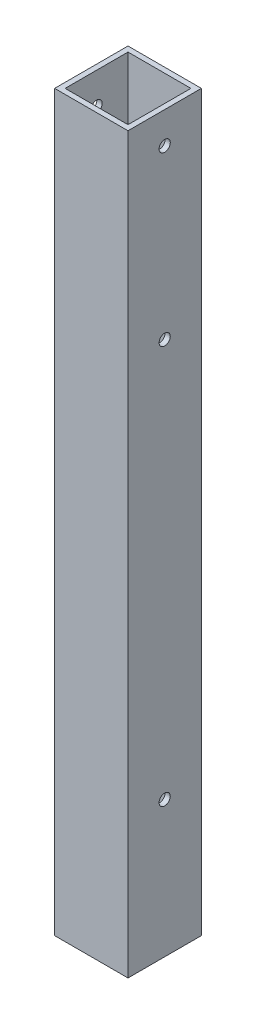
ISO-10303-21;
HEADER;
FILE_DESCRIPTION(('STEP AP214'),'2;1');
FILE_NAME('part.step','',(''),(''),'','','');
FILE_SCHEMA(('AUTOMOTIVE_DESIGN { 1 0 10303 214 1 1 1 1 }'));
ENDSEC;
DATA;
#1=APPLICATION_CONTEXT('core data for automotive mechanical design processes');
#2=APPLICATION_PROTOCOL_DEFINITION('international standard','automotive_design',2000,#1);
#3=PRODUCT_CONTEXT('',#1,'mechanical');
#4=PRODUCT('Part','Part','',(#3));
#5=PRODUCT_RELATED_PRODUCT_CATEGORY('part','',(#4));
#6=PRODUCT_DEFINITION_FORMATION('','',#4);
#7=PRODUCT_DEFINITION_CONTEXT('part definition',#1,'design');
#8=PRODUCT_DEFINITION('design','',#6,#7);
#9=PRODUCT_DEFINITION_SHAPE('','',#8);
#10=(LENGTH_UNIT() NAMED_UNIT(*) SI_UNIT(.MILLI.,.METRE.));
#11=(NAMED_UNIT(*) PLANE_ANGLE_UNIT() SI_UNIT($,.RADIAN.));
#12=(NAMED_UNIT(*) SI_UNIT($,.STERADIAN.) SOLID_ANGLE_UNIT());
#13=UNCERTAINTY_MEASURE_WITH_UNIT(LENGTH_MEASURE(1.E-05),#10,'distance_accuracy_value','');
#14=(GEOMETRIC_REPRESENTATION_CONTEXT(3) GLOBAL_UNCERTAINTY_ASSIGNED_CONTEXT((#13)) GLOBAL_UNIT_ASSIGNED_CONTEXT((#10,
#11,#12)) REPRESENTATION_CONTEXT('',''));
#15=CARTESIAN_POINT('',(0.,0.,0.));
#16=DIRECTION('',(0.,0.,1.));
#17=DIRECTION('',(1.,0.,0.));
#18=AXIS2_PLACEMENT_3D('',#15,#16,#17);
#19=CARTESIAN_POINT('',(-405.487908181794,205.374266552925,22.225));
#20=DIRECTION('',(-1.,0.,0.));
#21=DIRECTION('',(0.,0.,1.));
#22=AXIS2_PLACEMENT_3D('',#19,#20,#21);
#23=CYLINDRICAL_SURFACE('',#22,3.3782);
#24=CARTESIAN_POINT('',(0.,205.374266552925,22.225));
#25=DIRECTION('',(-1.,0.,0.));
#26=DIRECTION('',(0.,0.,1.));
#27=AXIS2_PLACEMENT_3D('',#24,#25,#26);
#28=CIRCLE('',#27,3.3782);
#29=CARTESIAN_POINT('',(0.,205.374266552925,25.6032));
#30=VERTEX_POINT('',#29);
#31=EDGE_CURVE('E116',#30,#30,#28,.T.);
#32=ORIENTED_EDGE('',*,*,#31,.T.);
#33=EDGE_LOOP('',(#32));
#34=FACE_BOUND('',#33,.T.);
#35=CARTESIAN_POINT('',(3.17499999999998,205.374266552925,22.225));
#36=DIRECTION('',(-1.,0.,0.));
#37=DIRECTION('',(0.,0.,1.));
#38=AXIS2_PLACEMENT_3D('',#35,#36,#37);
#39=CIRCLE('',#38,3.3782);
#40=CARTESIAN_POINT('',(3.17499999999998,205.374266552925,25.6032));
#41=VERTEX_POINT('',#40);
#42=EDGE_CURVE('E17',#41,#41,#39,.T.);
#43=ORIENTED_EDGE('',*,*,#42,.F.);
#44=EDGE_LOOP('',(#43));
#45=FACE_BOUND('',#44,.T.);
#46=ADVANCED_FACE('F14',(#34,#45),#23,.F.);
#47=CARTESIAN_POINT('',(-405.487908181794,446.674266552925,22.225));
#48=DIRECTION('',(-1.,0.,0.));
#49=DIRECTION('',(0.,0.,1.));
#50=AXIS2_PLACEMENT_3D('',#47,#48,#49);
#51=CYLINDRICAL_SURFACE('',#50,3.3782);
#52=CARTESIAN_POINT('',(0.,446.674266552925,22.225));
#53=DIRECTION('',(-1.,0.,0.));
#54=DIRECTION('',(0.,0.,1.));
#55=AXIS2_PLACEMENT_3D('',#52,#53,#54);
#56=CIRCLE('',#55,3.3782);
#57=CARTESIAN_POINT('',(0.,446.674266552925,25.6032));
#58=VERTEX_POINT('',#57);
#59=EDGE_CURVE('E134',#58,#58,#56,.T.);
#60=ORIENTED_EDGE('',*,*,#59,.T.);
#61=EDGE_LOOP('',(#60));
#62=FACE_BOUND('',#61,.T.);
#63=CARTESIAN_POINT('',(3.17499999999998,446.674266552925,22.225));
#64=DIRECTION('',(-1.,0.,0.));
#65=DIRECTION('',(0.,0.,1.));
#66=AXIS2_PLACEMENT_3D('',#63,#64,#65);
#67=CIRCLE('',#66,3.3782);
#68=CARTESIAN_POINT('',(3.17499999999998,446.674266552925,25.6032));
#69=VERTEX_POINT('',#68);
#70=EDGE_CURVE('E147',#69,#69,#67,.T.);
#71=ORIENTED_EDGE('',*,*,#70,.F.);
#72=EDGE_LOOP('',(#71));
#73=FACE_BOUND('',#72,.T.);
#74=ADVANCED_FACE('F156',(#62,#73),#51,.F.);
#75=CARTESIAN_POINT('',(-405.487908181794,548.274266552925,22.225));
#76=DIRECTION('',(-1.,0.,0.));
#77=DIRECTION('',(0.,0.,1.));
#78=AXIS2_PLACEMENT_3D('',#75,#76,#77);
#79=CYLINDRICAL_SURFACE('',#78,3.3782);
#80=CARTESIAN_POINT('',(0.,548.274266552925,22.225));
#81=DIRECTION('',(-1.,0.,0.));
#82=DIRECTION('',(0.,0.,1.));
#83=AXIS2_PLACEMENT_3D('',#80,#81,#82);
#84=CIRCLE('',#83,3.3782);
#85=CARTESIAN_POINT('',(0.,548.274266552925,25.6032));
#86=VERTEX_POINT('',#85);
#87=EDGE_CURVE('E113',#86,#86,#84,.T.);
#88=ORIENTED_EDGE('',*,*,#87,.T.);
#89=EDGE_LOOP('',(#88));
#90=FACE_BOUND('',#89,.T.);
#91=CARTESIAN_POINT('',(3.17499999999998,548.274266552925,22.225));
#92=DIRECTION('',(-1.,0.,0.));
#93=DIRECTION('',(0.,0.,1.));
#94=AXIS2_PLACEMENT_3D('',#91,#92,#93);
#95=CIRCLE('',#94,3.3782);
#96=CARTESIAN_POINT('',(3.17499999999998,548.274266552925,25.6032));
#97=VERTEX_POINT('',#96);
#98=EDGE_CURVE('E121',#97,#97,#95,.T.);
#99=ORIENTED_EDGE('',*,*,#98,.F.);
#100=EDGE_LOOP('',(#99));
#101=FACE_BOUND('',#100,.T.);
#102=ADVANCED_FACE('F162',(#90,#101),#79,.F.);
#103=CARTESIAN_POINT('',(-405.487908181794,205.374266552925,22.225));
#104=DIRECTION('',(-1.,0.,0.));
#105=DIRECTION('',(0.,0.,1.));
#106=AXIS2_PLACEMENT_3D('',#103,#104,#105);
#107=CYLINDRICAL_SURFACE('',#106,3.3782);
#108=CARTESIAN_POINT('',(41.275,205.374266552925,22.225));
#109=DIRECTION('',(-1.,0.,0.));
#110=DIRECTION('',(0.,0.,1.));
#111=AXIS2_PLACEMENT_3D('',#108,#109,#110);
#112=CIRCLE('',#111,3.3782);
#113=CARTESIAN_POINT('',(41.275,205.374266552925,25.6032));
#114=VERTEX_POINT('',#113);
#115=EDGE_CURVE('E86',#114,#114,#112,.T.);
#116=ORIENTED_EDGE('',*,*,#115,.T.);
#117=EDGE_LOOP('',(#116));
#118=FACE_BOUND('',#117,.T.);
#119=CARTESIAN_POINT('',(44.45,205.374266552925,22.225));
#120=DIRECTION('',(-1.,0.,0.));
#121=DIRECTION('',(0.,0.,1.));
#122=AXIS2_PLACEMENT_3D('',#119,#120,#121);
#123=CIRCLE('',#122,3.3782);
#124=CARTESIAN_POINT('',(44.45,205.374266552925,25.6032));
#125=VERTEX_POINT('',#124);
#126=EDGE_CURVE('E129',#125,#125,#123,.T.);
#127=ORIENTED_EDGE('',*,*,#126,.F.);
#128=EDGE_LOOP('',(#127));
#129=FACE_BOUND('',#128,.T.);
#130=ADVANCED_FACE('F208',(#118,#129),#107,.F.);
#131=CARTESIAN_POINT('',(-405.487908181794,446.674266552925,22.225));
#132=DIRECTION('',(-1.,0.,0.));
#133=DIRECTION('',(0.,0.,1.));
#134=AXIS2_PLACEMENT_3D('',#131,#132,#133);
#135=CYLINDRICAL_SURFACE('',#134,3.3782);
#136=CARTESIAN_POINT('',(41.275,446.674266552925,22.225));
#137=DIRECTION('',(-1.,0.,0.));
#138=DIRECTION('',(0.,0.,1.));
#139=AXIS2_PLACEMENT_3D('',#136,#137,#138);
#140=CIRCLE('',#139,3.3782);
#141=CARTESIAN_POINT('',(41.275,446.674266552925,25.6032));
#142=VERTEX_POINT('',#141);
#143=EDGE_CURVE('E141',#142,#142,#140,.T.);
#144=ORIENTED_EDGE('',*,*,#143,.T.);
#145=EDGE_LOOP('',(#144));
#146=FACE_BOUND('',#145,.T.);
#147=CARTESIAN_POINT('',(44.45,446.674266552925,22.225));
#148=DIRECTION('',(-1.,0.,0.));
#149=DIRECTION('',(0.,0.,1.));
#150=AXIS2_PLACEMENT_3D('',#147,#148,#149);
#151=CIRCLE('',#150,3.3782);
#152=CARTESIAN_POINT('',(44.45,446.674266552925,25.6032));
#153=VERTEX_POINT('',#152);
#154=EDGE_CURVE('E126',#153,#153,#151,.T.);
#155=ORIENTED_EDGE('',*,*,#154,.F.);
#156=EDGE_LOOP('',(#155));
#157=FACE_BOUND('',#156,.T.);
#158=ADVANCED_FACE('F204',(#146,#157),#135,.F.);
#159=CARTESIAN_POINT('',(-405.487908181794,548.274266552925,22.225));
#160=DIRECTION('',(-1.,0.,0.));
#161=DIRECTION('',(0.,0.,1.));
#162=AXIS2_PLACEMENT_3D('',#159,#160,#161);
#163=CYLINDRICAL_SURFACE('',#162,3.3782);
#164=CARTESIAN_POINT('',(41.275,548.274266552925,22.225));
#165=DIRECTION('',(-1.,0.,0.));
#166=DIRECTION('',(0.,0.,1.));
#167=AXIS2_PLACEMENT_3D('',#164,#165,#166);
#168=CIRCLE('',#167,3.3782);
#169=CARTESIAN_POINT('',(41.275,548.274266552925,25.6032));
#170=VERTEX_POINT('',#169);
#171=EDGE_CURVE('E118',#170,#170,#168,.T.);
#172=ORIENTED_EDGE('',*,*,#171,.T.);
#173=EDGE_LOOP('',(#172));
#174=FACE_BOUND('',#173,.T.);
#175=CARTESIAN_POINT('',(44.45,548.274266552925,22.225));
#176=DIRECTION('',(-1.,0.,0.));
#177=DIRECTION('',(0.,0.,1.));
#178=AXIS2_PLACEMENT_3D('',#175,#176,#177);
#179=CIRCLE('',#178,3.3782);
#180=CARTESIAN_POINT('',(44.45,548.274266552925,25.6032));
#181=VERTEX_POINT('',#180);
#182=EDGE_CURVE('E122',#181,#181,#179,.T.);
#183=ORIENTED_EDGE('',*,*,#182,.F.);
#184=EDGE_LOOP('',(#183));
#185=FACE_BOUND('',#184,.T.);
#186=ADVANCED_FACE('F200',(#174,#185),#163,.F.);
#187=CARTESIAN_POINT('',(44.45,345.074266552925,44.45));
#188=DIRECTION('',(0.,0.,1.));
#189=DIRECTION('',(0.,-1.,0.));
#190=AXIS2_PLACEMENT_3D('',#187,#188,#189);
#191=PLANE('',#190);
#192=DIRECTION('',(0.,1.,0.));
#193=VECTOR('',#192,1.);
#194=CARTESIAN_POINT('',(44.45,345.074266552925,44.45));
#195=LINE('',#194,#193);
#196=CARTESIAN_POINT('',(44.45,567.324266552925,44.45));
#197=VERTEX_POINT('',#196);
#198=CARTESIAN_POINT('',(44.45,122.824266552925,44.45));
#199=VERTEX_POINT('',#198);
#200=EDGE_CURVE('E341',#197,#199,#195,.F.);
#201=ORIENTED_EDGE('',*,*,#200,.F.);
#202=DIRECTION('',(1.,0.,0.));
#203=VECTOR('',#202,1.);
#204=CARTESIAN_POINT('',(44.45,567.324266552925,44.45));
#205=LINE('',#204,#203);
#206=CARTESIAN_POINT('',(0.,567.324266552925,44.45));
#207=VERTEX_POINT('',#206);
#208=EDGE_CURVE('E103',#207,#197,#205,.T.);
#209=ORIENTED_EDGE('',*,*,#208,.F.);
#210=DIRECTION('',(0.,1.,0.));
#211=VECTOR('',#210,1.);
#212=CARTESIAN_POINT('',(0.,345.074266552925,44.45));
#213=LINE('',#212,#211);
#214=CARTESIAN_POINT('',(0.,122.824266552925,44.45));
#215=VERTEX_POINT('',#214);
#216=EDGE_CURVE('E111',#207,#215,#213,.F.);
#217=ORIENTED_EDGE('',*,*,#216,.T.);
#218=DIRECTION('',(1.,0.,0.));
#219=VECTOR('',#218,1.);
#220=CARTESIAN_POINT('',(44.45,122.824266552925,44.45));
#221=LINE('',#220,#219);
#222=EDGE_CURVE('E344',#199,#215,#221,.F.);
#223=ORIENTED_EDGE('',*,*,#222,.F.);
#224=EDGE_LOOP('',(#201,#209,#217,#223));
#225=FACE_BOUND('',#224,.T.);
#226=ADVANCED_FACE('F196',(#225),#191,.T.);
#227=CARTESIAN_POINT('',(44.45,345.074266552925,3.175));
#228=DIRECTION('',(0.,0.,-1.));
#229=DIRECTION('',(0.,1.,0.));
#230=AXIS2_PLACEMENT_3D('',#227,#228,#229);
#231=PLANE('',#230);
#232=DIRECTION('',(1.,0.,0.));
#233=VECTOR('',#232,1.);
#234=CARTESIAN_POINT('',(44.45,122.824266552925,3.175));
#235=LINE('',#234,#233);
#236=CARTESIAN_POINT('',(41.275,122.824266552925,3.17500000000001));
#237=VERTEX_POINT('',#236);
#238=CARTESIAN_POINT('',(3.175,122.824266552925,3.17500000000001));
#239=VERTEX_POINT('',#238);
#240=EDGE_CURVE('E354',#237,#239,#235,.F.);
#241=ORIENTED_EDGE('',*,*,#240,.F.);
#242=DIRECTION('',(0.,1.,0.));
#243=VECTOR('',#242,1.);
#244=CARTESIAN_POINT('',(41.275,345.074266552925,3.175));
#245=LINE('',#244,#243);
#246=CARTESIAN_POINT('',(41.275,567.324266552925,3.17499999999999));
#247=VERTEX_POINT('',#246);
#248=EDGE_CURVE('E117',#237,#247,#245,.T.);
#249=ORIENTED_EDGE('',*,*,#248,.T.);
#250=DIRECTION('',(1.,0.,0.));
#251=VECTOR('',#250,1.);
#252=CARTESIAN_POINT('',(44.45,567.324266552925,3.175));
#253=LINE('',#252,#251);
#254=CARTESIAN_POINT('',(3.175,567.324266552925,3.175));
#255=VERTEX_POINT('',#254);
#256=EDGE_CURVE('E96',#255,#247,#253,.T.);
#257=ORIENTED_EDGE('',*,*,#256,.F.);
#258=DIRECTION('',(0.,1.,0.));
#259=VECTOR('',#258,1.);
#260=CARTESIAN_POINT('',(3.175,345.074266552925,3.175));
#261=LINE('',#260,#259);
#262=EDGE_CURVE('E87',#239,#255,#261,.T.);
#263=ORIENTED_EDGE('',*,*,#262,.F.);
#264=EDGE_LOOP('',(#241,#249,#257,#263));
#265=FACE_BOUND('',#264,.T.);
#266=ADVANCED_FACE('F193',(#265),#231,.F.);
#267=CARTESIAN_POINT('',(3.175,345.074266552925,22.225));
#268=DIRECTION('',(1.,0.,0.));
#269=DIRECTION('',(0.,0.,-1.));
#270=AXIS2_PLACEMENT_3D('',#267,#268,#269);
#271=PLANE('',#270);
#272=DIRECTION('',(0.,0.,1.));
#273=VECTOR('',#272,1.);
#274=CARTESIAN_POINT('',(3.175,567.324266552925,22.225));
#275=LINE('',#274,#273);
#276=CARTESIAN_POINT('',(3.175,567.324266552925,41.275));
#277=VERTEX_POINT('',#276);
#278=EDGE_CURVE('E90',#277,#255,#275,.F.);
#279=ORIENTED_EDGE('',*,*,#278,.F.);
#280=DIRECTION('',(0.,-1.,0.));
#281=VECTOR('',#280,1.);
#282=CARTESIAN_POINT('',(3.175,345.074266552925,41.275));
#283=LINE('',#282,#281);
#284=CARTESIAN_POINT('',(3.175,122.824266552925,41.275));
#285=VERTEX_POINT('',#284);
#286=EDGE_CURVE('E75',#277,#285,#283,.T.);
#287=ORIENTED_EDGE('',*,*,#286,.T.);
#288=DIRECTION('',(0.,0.,-1.));
#289=VECTOR('',#288,1.);
#290=CARTESIAN_POINT('',(3.175,122.824266552925,22.225));
#291=LINE('',#290,#289);
#292=EDGE_CURVE('E361',#239,#285,#291,.F.);
#293=ORIENTED_EDGE('',*,*,#292,.F.);
#294=ORIENTED_EDGE('',*,*,#262,.T.);
#295=EDGE_LOOP('',(#279,#287,#293,#294));
#296=FACE_BOUND('',#295,.T.);
#297=ORIENTED_EDGE('',*,*,#98,.T.);
#298=EDGE_LOOP('',(#297));
#299=FACE_BOUND('',#298,.T.);
#300=ORIENTED_EDGE('',*,*,#70,.T.);
#301=EDGE_LOOP('',(#300));
#302=FACE_BOUND('',#301,.T.);
#303=ORIENTED_EDGE('',*,*,#42,.T.);
#304=EDGE_LOOP('',(#303));
#305=FACE_BOUND('',#304,.T.);
#306=ADVANCED_FACE('F91',(#296,#299,#302,#305),#271,.T.);
#307=CARTESIAN_POINT('',(44.45,345.074266552925,41.275));
#308=DIRECTION('',(0.,0.,1.));
#309=DIRECTION('',(0.,-1.,0.));
#310=AXIS2_PLACEMENT_3D('',#307,#308,#309);
#311=PLANE('',#310);
#312=DIRECTION('',(1.,0.,0.));
#313=VECTOR('',#312,1.);
#314=CARTESIAN_POINT('',(44.45,567.324266552925,41.275));
#315=LINE('',#314,#313);
#316=CARTESIAN_POINT('',(41.275,567.324266552925,41.275));
#317=VERTEX_POINT('',#316);
#318=EDGE_CURVE('E79',#317,#277,#315,.F.);
#319=ORIENTED_EDGE('',*,*,#318,.F.);
#320=DIRECTION('',(0.,1.,0.));
#321=VECTOR('',#320,1.);
#322=CARTESIAN_POINT('',(41.275,345.074266552925,41.275));
#323=LINE('',#322,#321);
#324=CARTESIAN_POINT('',(41.275,122.824266552925,41.275));
#325=VERTEX_POINT('',#324);
#326=EDGE_CURVE('E114',#317,#325,#323,.F.);
#327=ORIENTED_EDGE('',*,*,#326,.T.);
#328=DIRECTION('',(1.,0.,0.));
#329=VECTOR('',#328,1.);
#330=CARTESIAN_POINT('',(44.45,122.824266552925,41.275));
#331=LINE('',#330,#329);
#332=EDGE_CURVE('E82',#285,#325,#331,.T.);
#333=ORIENTED_EDGE('',*,*,#332,.F.);
#334=ORIENTED_EDGE('',*,*,#286,.F.);
#335=EDGE_LOOP('',(#319,#327,#333,#334));
#336=FACE_BOUND('',#335,.T.);
#337=ADVANCED_FACE('F77',(#336),#311,.F.);
#338=CARTESIAN_POINT('',(41.275,345.074266552925,22.225));
#339=DIRECTION('',(1.,0.,0.));
#340=DIRECTION('',(0.,0.,-1.));
#341=AXIS2_PLACEMENT_3D('',#338,#339,#340);
#342=PLANE('',#341);
#343=ORIENTED_EDGE('',*,*,#326,.F.);
#344=DIRECTION('',(0.,0.,1.));
#345=VECTOR('',#344,1.);
#346=CARTESIAN_POINT('',(41.275,567.324266552925,22.225));
#347=LINE('',#346,#345);
#348=EDGE_CURVE('E102',#247,#317,#347,.T.);
#349=ORIENTED_EDGE('',*,*,#348,.F.);
#350=ORIENTED_EDGE('',*,*,#248,.F.);
#351=DIRECTION('',(0.,0.,-1.));
#352=VECTOR('',#351,1.);
#353=CARTESIAN_POINT('',(41.275,122.824266552925,22.225));
#354=LINE('',#353,#352);
#355=EDGE_CURVE('E357',#325,#237,#354,.T.);
#356=ORIENTED_EDGE('',*,*,#355,.F.);
#357=EDGE_LOOP('',(#343,#349,#350,#356));
#358=FACE_BOUND('',#357,.T.);
#359=ORIENTED_EDGE('',*,*,#171,.F.);
#360=EDGE_LOOP('',(#359));
#361=FACE_BOUND('',#360,.T.);
#362=ORIENTED_EDGE('',*,*,#143,.F.);
#363=EDGE_LOOP('',(#362));
#364=FACE_BOUND('',#363,.T.);
#365=ORIENTED_EDGE('',*,*,#115,.F.);
#366=EDGE_LOOP('',(#365));
#367=FACE_BOUND('',#366,.T.);
#368=ADVANCED_FACE('F184',(#358,#361,#364,#367),#342,.F.);
#369=CARTESIAN_POINT('',(0.,345.074266552925,22.225));
#370=DIRECTION('',(1.,0.,0.));
#371=DIRECTION('',(0.,0.,-1.));
#372=AXIS2_PLACEMENT_3D('',#369,#370,#371);
#373=PLANE('',#372);
#374=ORIENTED_EDGE('',*,*,#216,.F.);
#375=DIRECTION('',(0.,0.,1.));
#376=VECTOR('',#375,1.);
#377=CARTESIAN_POINT('',(0.,567.324266552925,22.225));
#378=LINE('',#377,#376);
#379=CARTESIAN_POINT('',(0.,567.324266552925,0.));
#380=VERTEX_POINT('',#379);
#381=EDGE_CURVE('E105',#380,#207,#378,.T.);
#382=ORIENTED_EDGE('',*,*,#381,.F.);
#383=DIRECTION('',(0.,1.,0.));
#384=VECTOR('',#383,1.);
#385=CARTESIAN_POINT('',(0.,345.074266552925,0.));
#386=LINE('',#385,#384);
#387=CARTESIAN_POINT('',(0.,122.824266552925,0.));
#388=VERTEX_POINT('',#387);
#389=EDGE_CURVE('E358',#388,#380,#386,.T.);
#390=ORIENTED_EDGE('',*,*,#389,.F.);
#391=DIRECTION('',(0.,0.,-1.));
#392=VECTOR('',#391,1.);
#393=CARTESIAN_POINT('',(0.,122.824266552925,22.225));
#394=LINE('',#393,#392);
#395=EDGE_CURVE('E345',#215,#388,#394,.T.);
#396=ORIENTED_EDGE('',*,*,#395,.F.);
#397=EDGE_LOOP('',(#374,#382,#390,#396));
#398=FACE_BOUND('',#397,.T.);
#399=ORIENTED_EDGE('',*,*,#87,.F.);
#400=EDGE_LOOP('',(#399));
#401=FACE_BOUND('',#400,.T.);
#402=ORIENTED_EDGE('',*,*,#59,.F.);
#403=EDGE_LOOP('',(#402));
#404=FACE_BOUND('',#403,.T.);
#405=ORIENTED_EDGE('',*,*,#31,.F.);
#406=EDGE_LOOP('',(#405));
#407=FACE_BOUND('',#406,.T.);
#408=ADVANCED_FACE('F181',(#398,#401,#404,#407),#373,.F.);
#409=CARTESIAN_POINT('',(44.45,567.324266552925,22.225));
#410=DIRECTION('',(0.,1.,0.));
#411=DIRECTION('',(0.,0.,1.));
#412=AXIS2_PLACEMENT_3D('',#409,#410,#411);
#413=PLANE('',#412);
#414=ORIENTED_EDGE('',*,*,#256,.T.);
#415=ORIENTED_EDGE('',*,*,#348,.T.);
#416=ORIENTED_EDGE('',*,*,#318,.T.);
#417=ORIENTED_EDGE('',*,*,#278,.T.);
#418=EDGE_LOOP('',(#414,#415,#416,#417));
#419=FACE_BOUND('',#418,.T.);
#420=DIRECTION('',(0.,0.,-1.));
#421=VECTOR('',#420,1.);
#422=CARTESIAN_POINT('',(44.45,567.324266552925,22.225));
#423=LINE('',#422,#421);
#424=CARTESIAN_POINT('',(44.45,567.324266552925,0.));
#425=VERTEX_POINT('',#424);
#426=EDGE_CURVE('E125',#425,#197,#423,.F.);
#427=ORIENTED_EDGE('',*,*,#426,.F.);
#428=DIRECTION('',(1.,0.,0.));
#429=VECTOR('',#428,1.);
#430=CARTESIAN_POINT('',(44.45,567.324266552925,0.));
#431=LINE('',#430,#429);
#432=EDGE_CURVE('E372',#380,#425,#431,.T.);
#433=ORIENTED_EDGE('',*,*,#432,.F.);
#434=ORIENTED_EDGE('',*,*,#381,.T.);
#435=ORIENTED_EDGE('',*,*,#208,.T.);
#436=EDGE_LOOP('',(#427,#433,#434,#435));
#437=FACE_BOUND('',#436,.T.);
#438=ADVANCED_FACE('F99',(#419,#437),#413,.T.);
#439=CARTESIAN_POINT('',(44.45,345.074266552925,22.225));
#440=DIRECTION('',(1.,0.,0.));
#441=DIRECTION('',(0.,0.,-1.));
#442=AXIS2_PLACEMENT_3D('',#439,#440,#441);
#443=PLANE('',#442);
#444=ORIENTED_EDGE('',*,*,#426,.T.);
#445=ORIENTED_EDGE('',*,*,#200,.T.);
#446=DIRECTION('',(0.,0.,-1.));
#447=VECTOR('',#446,1.);
#448=CARTESIAN_POINT('',(44.45,122.824266552925,22.225));
#449=LINE('',#448,#447);
#450=CARTESIAN_POINT('',(44.45,122.824266552925,0.));
#451=VERTEX_POINT('',#450);
#452=EDGE_CURVE('E32',#451,#199,#449,.F.);
#453=ORIENTED_EDGE('',*,*,#452,.F.);
#454=DIRECTION('',(0.,1.,0.));
#455=VECTOR('',#454,1.);
#456=CARTESIAN_POINT('',(44.45,345.074266552925,0.));
#457=LINE('',#456,#455);
#458=EDGE_CURVE('E23',#425,#451,#457,.F.);
#459=ORIENTED_EDGE('',*,*,#458,.F.);
#460=EDGE_LOOP('',(#444,#445,#453,#459));
#461=FACE_BOUND('',#460,.T.);
#462=ORIENTED_EDGE('',*,*,#182,.T.);
#463=EDGE_LOOP('',(#462));
#464=FACE_BOUND('',#463,.T.);
#465=ORIENTED_EDGE('',*,*,#154,.T.);
#466=EDGE_LOOP('',(#465));
#467=FACE_BOUND('',#466,.T.);
#468=ORIENTED_EDGE('',*,*,#126,.T.);
#469=EDGE_LOOP('',(#468));
#470=FACE_BOUND('',#469,.T.);
#471=ADVANCED_FACE('F172',(#461,#464,#467,#470),#443,.T.);
#472=CARTESIAN_POINT('',(44.45,122.824266552925,22.225));
#473=DIRECTION('',(0.,-1.,0.));
#474=DIRECTION('',(0.,0.,-1.));
#475=AXIS2_PLACEMENT_3D('',#472,#473,#474);
#476=PLANE('',#475);
#477=ORIENTED_EDGE('',*,*,#332,.T.);
#478=ORIENTED_EDGE('',*,*,#355,.T.);
#479=ORIENTED_EDGE('',*,*,#240,.T.);
#480=ORIENTED_EDGE('',*,*,#292,.T.);
#481=EDGE_LOOP('',(#477,#478,#479,#480));
#482=FACE_BOUND('',#481,.T.);
#483=ORIENTED_EDGE('',*,*,#452,.T.);
#484=ORIENTED_EDGE('',*,*,#222,.T.);
#485=ORIENTED_EDGE('',*,*,#395,.T.);
#486=DIRECTION('',(1.,0.,0.));
#487=VECTOR('',#486,1.);
#488=CARTESIAN_POINT('',(44.45,122.824266552925,0.));
#489=LINE('',#488,#487);
#490=EDGE_CURVE('E9',#451,#388,#489,.F.);
#491=ORIENTED_EDGE('',*,*,#490,.F.);
#492=EDGE_LOOP('',(#483,#484,#485,#491));
#493=FACE_BOUND('',#492,.T.);
#494=ADVANCED_FACE('F166',(#482,#493),#476,.T.);
#495=CARTESIAN_POINT('',(44.45,345.074266552925,0.));
#496=DIRECTION('',(0.,0.,-1.));
#497=DIRECTION('',(0.,1.,0.));
#498=AXIS2_PLACEMENT_3D('',#495,#496,#497);
#499=PLANE('',#498);
#500=ORIENTED_EDGE('',*,*,#458,.T.);
#501=ORIENTED_EDGE('',*,*,#490,.T.);
#502=ORIENTED_EDGE('',*,*,#389,.T.);
#503=ORIENTED_EDGE('',*,*,#432,.T.);
#504=EDGE_LOOP('',(#500,#501,#502,#503));
#505=FACE_BOUND('',#504,.T.);
#506=ADVANCED_FACE('F164',(#505),#499,.T.);
#507=CLOSED_SHELL('',(#46,#74,#102,#130,#158,#186,#226,#266,#306,#337,#368,#408,#438,#471,#494,#506));
#508=MANIFOLD_SOLID_BREP('B1',#507);
#509=ADVANCED_BREP_SHAPE_REPRESENTATION('',(#18,#508),#14);
#510=SHAPE_DEFINITION_REPRESENTATION(#9,#509);
ENDSEC;
END-ISO-10303-21;
